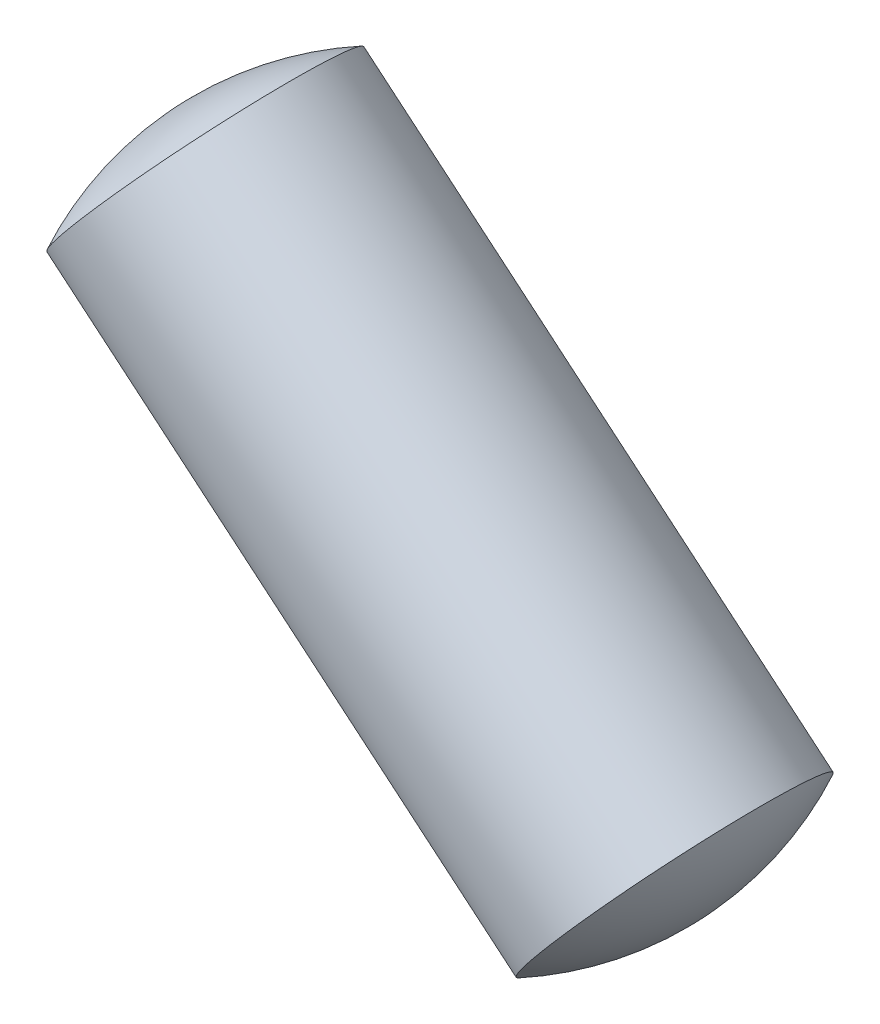
ISO-10303-21;
HEADER;
FILE_DESCRIPTION(('STEP AP214'),'2;1');
FILE_NAME('part.step','',(''),(''),'','','');
FILE_SCHEMA(('AUTOMOTIVE_DESIGN { 1 0 10303 214 1 1 1 1 }'));
ENDSEC;
DATA;
#1=APPLICATION_CONTEXT('core data for automotive mechanical design processes');
#2=APPLICATION_PROTOCOL_DEFINITION('international standard','automotive_design',2000,#1);
#3=PRODUCT_CONTEXT('',#1,'mechanical');
#4=PRODUCT('Part','Part','',(#3));
#5=PRODUCT_RELATED_PRODUCT_CATEGORY('part','',(#4));
#6=PRODUCT_DEFINITION_FORMATION('','',#4);
#7=PRODUCT_DEFINITION_CONTEXT('part definition',#1,'design');
#8=PRODUCT_DEFINITION('design','',#6,#7);
#9=PRODUCT_DEFINITION_SHAPE('','',#8);
#10=(LENGTH_UNIT() NAMED_UNIT(*) SI_UNIT(.MILLI.,.METRE.));
#11=(NAMED_UNIT(*) PLANE_ANGLE_UNIT() SI_UNIT($,.RADIAN.));
#12=(NAMED_UNIT(*) SI_UNIT($,.STERADIAN.) SOLID_ANGLE_UNIT());
#13=UNCERTAINTY_MEASURE_WITH_UNIT(LENGTH_MEASURE(1.E-05),#10,'distance_accuracy_value','');
#14=(GEOMETRIC_REPRESENTATION_CONTEXT(3) GLOBAL_UNCERTAINTY_ASSIGNED_CONTEXT((#13)) GLOBAL_UNIT_ASSIGNED_CONTEXT((#10,
#11,#12)) REPRESENTATION_CONTEXT('',''));
#15=CARTESIAN_POINT('',(0.,0.,0.));
#16=DIRECTION('',(0.,0.,1.));
#17=DIRECTION('',(1.,0.,0.));
#18=AXIS2_PLACEMENT_3D('',#15,#16,#17);
#19=CARTESIAN_POINT('',(17.0946163604771,-14.3402159381273,0.6));
#20=DIRECTION('',(-0.642685815059881,-0.7661298474285,0.));
#21=DIRECTION('',(0.7661298474285,-0.642685815059881,0.));
#22=AXIS2_PLACEMENT_3D('',#19,#20,#21);
#23=SPHERICAL_SURFACE('',#22,2.);
#24=CARTESIAN_POINT('',(17.0946163604771,-14.3402159381273,0.6));
#25=DIRECTION('',(-0.7661298474285,0.642685815059881,0.));
#26=DIRECTION('',(0.,0.,-1.));
#27=AXIS2_PLACEMENT_3D('',#24,#25,#26);
#28=SPHERICAL_SURFACE('',#27,2.);
#29=CARTESIAN_POINT('',(18.4215921814183,-15.4533804231148,0.599999999999989));
#30=DIRECTION('',(-0.7661298474285,0.642685815059881,0.));
#31=DIRECTION('',(0.,0.,-1.));
#32=AXIS2_PLACEMENT_3D('',#29,#30,#31);
#33=CIRCLE('',#32,1.);
#34=CARTESIAN_POINT('',(18.4215921814183,-15.4533804231148,-0.400000000000011));
#35=VERTEX_POINT('',#34);
#36=EDGE_CURVE('E11',#35,#35,#33,.T.);
#37=ORIENTED_EDGE('',*,*,#36,.F.);
#38=EDGE_LOOP('',(#37));
#39=FACE_BOUND('',#38,.T.);
#40=ADVANCED_FACE('F17',(#39),#28,.T.);
#41=CARTESIAN_POINT('',(16.2320320026626,-13.6166170169775,0.599999999999989));
#42=DIRECTION('',(-0.642685815059881,-0.7661298474285,0.));
#43=DIRECTION('',(-0.7661298474285,0.642685815059881,0.));
#44=AXIS2_PLACEMENT_3D('',#41,#42,#43);
#45=SPHERICAL_SURFACE('',#44,2.);
#46=CARTESIAN_POINT('',(16.2320320026626,-13.6166170169775,0.599999999999989));
#47=DIRECTION('',(-0.7661298474285,0.642685815059881,0.));
#48=DIRECTION('',(0.,0.,-1.));
#49=AXIS2_PLACEMENT_3D('',#46,#47,#48);
#50=SPHERICAL_SURFACE('',#49,2.);
#51=CARTESIAN_POINT('',(14.9050561817215,-12.50345253199,0.6));
#52=DIRECTION('',(-0.7661298474285,0.642685815059881,0.));
#53=DIRECTION('',(0.,0.,-1.));
#54=AXIS2_PLACEMENT_3D('',#51,#52,#53);
#55=CIRCLE('',#54,1.);
#56=CARTESIAN_POINT('',(14.9050561817215,-12.50345253199,-0.4));
#57=VERTEX_POINT('',#56);
#58=EDGE_CURVE('E20',#57,#57,#55,.T.);
#59=ORIENTED_EDGE('',*,*,#58,.T.);
#60=EDGE_LOOP('',(#59));
#61=FACE_BOUND('',#60,.T.);
#62=ADVANCED_FACE('F39',(#61),#50,.T.);
#63=CARTESIAN_POINT('',(15.7841901816457,-13.2409345047713,0.599999999999989));
#64=DIRECTION('',(-0.7661298474285,0.642685815059881,0.));
#65=DIRECTION('',(0.,0.,-1.));
#66=AXIS2_PLACEMENT_3D('',#63,#64,#65);
#67=CYLINDRICAL_SURFACE('',#66,1.);
#68=ORIENTED_EDGE('',*,*,#36,.T.);
#69=EDGE_LOOP('',(#68));
#70=FACE_BOUND('',#69,.T.);
#71=ORIENTED_EDGE('',*,*,#58,.F.);
#72=EDGE_LOOP('',(#71));
#73=FACE_BOUND('',#72,.T.);
#74=ADVANCED_FACE('F47',(#70,#73),#67,.T.);
#75=CLOSED_SHELL('',(#40,#62,#74));
#76=MANIFOLD_SOLID_BREP('B1',#75);
#77=ADVANCED_BREP_SHAPE_REPRESENTATION('',(#18,#76),#14);
#78=SHAPE_DEFINITION_REPRESENTATION(#9,#77);
ENDSEC;
END-ISO-10303-21;
